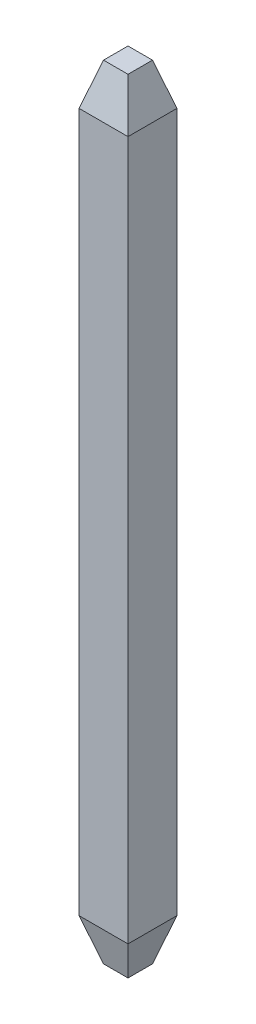
ISO-10303-21;
HEADER;
FILE_DESCRIPTION(('STEP AP214'),'2;1');
FILE_NAME('part.step','',(''),(''),'','','');
FILE_SCHEMA(('AUTOMOTIVE_DESIGN { 1 0 10303 214 1 1 1 1 }'));
ENDSEC;
DATA;
#1=APPLICATION_CONTEXT('core data for automotive mechanical design processes');
#2=APPLICATION_PROTOCOL_DEFINITION('international standard','automotive_design',2000,#1);
#3=PRODUCT_CONTEXT('',#1,'mechanical');
#4=PRODUCT('Part','Part','',(#3));
#5=PRODUCT_RELATED_PRODUCT_CATEGORY('part','',(#4));
#6=PRODUCT_DEFINITION_FORMATION('','',#4);
#7=PRODUCT_DEFINITION_CONTEXT('part definition',#1,'design');
#8=PRODUCT_DEFINITION('design','',#6,#7);
#9=PRODUCT_DEFINITION_SHAPE('','',#8);
#10=(LENGTH_UNIT() NAMED_UNIT(*) SI_UNIT(.MILLI.,.METRE.));
#11=(NAMED_UNIT(*) PLANE_ANGLE_UNIT() SI_UNIT($,.RADIAN.));
#12=(NAMED_UNIT(*) SI_UNIT($,.STERADIAN.) SOLID_ANGLE_UNIT());
#13=UNCERTAINTY_MEASURE_WITH_UNIT(LENGTH_MEASURE(1.E-05),#10,'distance_accuracy_value','');
#14=(GEOMETRIC_REPRESENTATION_CONTEXT(3) GLOBAL_UNCERTAINTY_ASSIGNED_CONTEXT((#13)) GLOBAL_UNIT_ASSIGNED_CONTEXT((#10,
#11,#12)) REPRESENTATION_CONTEXT('',''));
#15=CARTESIAN_POINT('',(0.,0.,0.));
#16=DIRECTION('',(0.,0.,1.));
#17=DIRECTION('',(1.,0.,0.));
#18=AXIS2_PLACEMENT_3D('',#15,#16,#17);
#19=CARTESIAN_POINT('',(14.4510000000129,-5.53443505344787,-19.8399999999763));
#20=DIRECTION('',(0.,0.,-1.));
#21=DIRECTION('',(0.,-1.,0.));
#22=AXIS2_PLACEMENT_3D('',#19,#20,#21);
#23=PLANE('',#22);
#24=DIRECTION('',(0.,1.,0.));
#25=VECTOR('',#24,1.);
#26=CARTESIAN_POINT('',(14.4500000000129,-10.1039999999831,-19.8399999999763));
#27=LINE('',#26,#25);
#28=CARTESIAN_POINT('',(14.4500000000129,-10.1039999999831,-19.8399999999763));
#29=VERTEX_POINT('',#28);
#30=CARTESIAN_POINT('',(14.4500000000129,-0.965870106912631,-19.8399999999763));
#31=VERTEX_POINT('',#30);
#32=EDGE_CURVE('E160',#29,#31,#27,.T.);
#33=ORIENTED_EDGE('',*,*,#32,.F.);
#34=DIRECTION('',(1.,0.,0.));
#35=VECTOR('',#34,1.);
#36=CARTESIAN_POINT('',(13.8100000000129,-10.1039999999831,-19.8399999999763));
#37=LINE('',#36,#35);
#38=CARTESIAN_POINT('',(13.8100000000129,-10.1039999999831,-19.8399999999763));
#39=VERTEX_POINT('',#38);
#40=EDGE_CURVE('E42',#39,#29,#37,.T.);
#41=ORIENTED_EDGE('',*,*,#40,.F.);
#42=DIRECTION('',(0.,1.,0.));
#43=VECTOR('',#42,1.);
#44=CARTESIAN_POINT('',(13.8100000000129,-10.1039999999831,-19.8399999999763));
#45=LINE('',#44,#43);
#46=CARTESIAN_POINT('',(13.8100000000129,-0.965870106912631,-19.8399999999763));
#47=VERTEX_POINT('',#46);
#48=EDGE_CURVE('E11',#39,#47,#45,.T.);
#49=ORIENTED_EDGE('',*,*,#48,.T.);
#50=DIRECTION('',(1.,0.,0.));
#51=VECTOR('',#50,1.);
#52=CARTESIAN_POINT('',(13.8100000000129,-0.965870106912629,-19.8399999999763));
#53=LINE('',#52,#51);
#54=EDGE_CURVE('E28',#47,#31,#53,.T.);
#55=ORIENTED_EDGE('',*,*,#54,.T.);
#56=EDGE_LOOP('',(#33,#41,#49,#55));
#57=FACE_BOUND('',#56,.T.);
#58=ADVANCED_FACE('F17',(#57),#23,.T.);
#59=CARTESIAN_POINT('',(14.4500000000129,-11.0738701069126,-19.5199999999763));
#60=DIRECTION('',(1.,0.,0.));
#61=DIRECTION('',(0.,1.,0.));
#62=AXIS2_PLACEMENT_3D('',#59,#60,#61);
#63=PLANE('',#62);
#64=DIRECTION('',(0.,1.,0.));
#65=VECTOR('',#64,1.);
#66=CARTESIAN_POINT('',(14.4500000000129,-10.1039999999831,-19.1999999999763));
#67=LINE('',#66,#65);
#68=CARTESIAN_POINT('',(14.4500000000129,-10.1039999999831,-19.1999999999763));
#69=VERTEX_POINT('',#68);
#70=CARTESIAN_POINT('',(14.4500000000129,-0.965870106912631,-19.1999999999763));
#71=VERTEX_POINT('',#70);
#72=EDGE_CURVE('E142',#69,#71,#67,.T.);
#73=ORIENTED_EDGE('',*,*,#72,.F.);
#74=DIRECTION('',(0.,0.,1.));
#75=VECTOR('',#74,1.);
#76=CARTESIAN_POINT('',(14.4500000000129,-10.1039999999831,-19.8399999999763));
#77=LINE('',#76,#75);
#78=EDGE_CURVE('E122',#29,#69,#77,.T.);
#79=ORIENTED_EDGE('',*,*,#78,.F.);
#80=ORIENTED_EDGE('',*,*,#32,.T.);
#81=DIRECTION('',(0.,0.,1.));
#82=VECTOR('',#81,1.);
#83=CARTESIAN_POINT('',(14.4500000000129,-0.965870106912629,-19.8399999999763));
#84=LINE('',#83,#82);
#85=EDGE_CURVE('E126',#31,#71,#84,.T.);
#86=ORIENTED_EDGE('',*,*,#85,.T.);
#87=EDGE_LOOP('',(#73,#79,#80,#86));
#88=FACE_BOUND('',#87,.T.);
#89=ADVANCED_FACE('F225',(#88),#63,.T.);
#90=CARTESIAN_POINT('',(13.8090000000129,-5.53543505344787,-19.1999999999763));
#91=DIRECTION('',(0.,0.,1.));
#92=DIRECTION('',(1.,0.,0.));
#93=AXIS2_PLACEMENT_3D('',#90,#91,#92);
#94=PLANE('',#93);
#95=DIRECTION('',(0.,1.,0.));
#96=VECTOR('',#95,1.);
#97=CARTESIAN_POINT('',(13.8100000000129,-10.1039999999831,-19.1999999999763));
#98=LINE('',#97,#96);
#99=CARTESIAN_POINT('',(13.8100000000129,-10.1039999999831,-19.1999999999763));
#100=VERTEX_POINT('',#99);
#101=CARTESIAN_POINT('',(13.8100000000129,-0.965870106912631,-19.1999999999763));
#102=VERTEX_POINT('',#101);
#103=EDGE_CURVE('E114',#100,#102,#98,.T.);
#104=ORIENTED_EDGE('',*,*,#103,.F.);
#105=DIRECTION('',(-1.,0.,0.));
#106=VECTOR('',#105,1.);
#107=CARTESIAN_POINT('',(14.4500000000129,-10.1039999999831,-19.1999999999763));
#108=LINE('',#107,#106);
#109=EDGE_CURVE('E176',#69,#100,#108,.T.);
#110=ORIENTED_EDGE('',*,*,#109,.F.);
#111=ORIENTED_EDGE('',*,*,#72,.T.);
#112=DIRECTION('',(-1.,0.,0.));
#113=VECTOR('',#112,1.);
#114=CARTESIAN_POINT('',(14.4500000000129,-0.965870106912629,-19.1999999999763));
#115=LINE('',#114,#113);
#116=EDGE_CURVE('E146',#71,#102,#115,.T.);
#117=ORIENTED_EDGE('',*,*,#116,.T.);
#118=EDGE_LOOP('',(#104,#110,#111,#117));
#119=FACE_BOUND('',#118,.T.);
#120=ADVANCED_FACE('F19',(#119),#94,.T.);
#121=CARTESIAN_POINT('',(14.1300000000129,-0.965870106912629,-19.1999999999763));
#122=DIRECTION('',(0.,0.281214622974643,0.959644900900968));
#123=DIRECTION('',(1.,0.,0.));
#124=AXIS2_PLACEMENT_3D('',#121,#122,#123);
#125=PLANE('',#124);
#126=DIRECTION('',(-0.270714017147724,0.923811583516618,-0.270714017147727));
#127=VECTOR('',#126,1.);
#128=CARTESIAN_POINT('',(14.4500000000129,-0.965870106912629,-19.1999999999763));
#129=LINE('',#128,#127);
#130=CARTESIAN_POINT('',(14.2900000000129,-0.419870106912631,-19.3599999999763));
#131=VERTEX_POINT('',#130);
#132=EDGE_CURVE('E21',#71,#131,#129,.T.);
#133=ORIENTED_EDGE('',*,*,#132,.T.);
#134=DIRECTION('',(-1.,0.,0.));
#135=VECTOR('',#134,1.);
#136=CARTESIAN_POINT('',(14.2900000000129,-0.419870106912629,-19.3599999999763));
#137=LINE('',#136,#135);
#138=CARTESIAN_POINT('',(13.9700000000129,-0.419870106912631,-19.3599999999763));
#139=VERTEX_POINT('',#138);
#140=EDGE_CURVE('E78',#131,#139,#137,.T.);
#141=ORIENTED_EDGE('',*,*,#140,.T.);
#142=DIRECTION('',(0.270714017147727,0.923811583516618,-0.270714017147727));
#143=VECTOR('',#142,1.);
#144=CARTESIAN_POINT('',(13.8100000000129,-0.965870106912629,-19.1999999999763));
#145=LINE('',#144,#143);
#146=EDGE_CURVE('E90',#102,#139,#145,.T.);
#147=ORIENTED_EDGE('',*,*,#146,.F.);
#148=ORIENTED_EDGE('',*,*,#116,.F.);
#149=EDGE_LOOP('',(#133,#141,#147,#148));
#150=FACE_BOUND('',#149,.T.);
#151=ADVANCED_FACE('F231',(#150),#125,.T.);
#152=CARTESIAN_POINT('',(13.8100000000129,-0.965870106912629,-19.5199999999763));
#153=DIRECTION('',(-0.959644900900968,0.281214622974643,0.));
#154=DIRECTION('',(0.,0.,1.));
#155=AXIS2_PLACEMENT_3D('',#152,#153,#154);
#156=PLANE('',#155);
#157=ORIENTED_EDGE('',*,*,#146,.T.);
#158=DIRECTION('',(0.,0.,-1.));
#159=VECTOR('',#158,1.);
#160=CARTESIAN_POINT('',(13.9700000000129,-0.419870106912629,-19.3599999999763));
#161=LINE('',#160,#159);
#162=CARTESIAN_POINT('',(13.9700000000129,-0.419870106912631,-19.6799999999763));
#163=VERTEX_POINT('',#162);
#164=EDGE_CURVE('E180',#139,#163,#161,.T.);
#165=ORIENTED_EDGE('',*,*,#164,.T.);
#166=DIRECTION('',(0.270714017147727,0.923811583516618,0.270714017147727));
#167=VECTOR('',#166,1.);
#168=CARTESIAN_POINT('',(13.8100000000129,-0.965870106912629,-19.8399999999763));
#169=LINE('',#168,#167);
#170=EDGE_CURVE('E112',#47,#163,#169,.T.);
#171=ORIENTED_EDGE('',*,*,#170,.F.);
#172=DIRECTION('',(0.,0.,-1.));
#173=VECTOR('',#172,1.);
#174=CARTESIAN_POINT('',(13.8100000000129,-0.965870106912629,-19.1999999999763));
#175=LINE('',#174,#173);
#176=EDGE_CURVE('E149',#102,#47,#175,.T.);
#177=ORIENTED_EDGE('',*,*,#176,.F.);
#178=EDGE_LOOP('',(#157,#165,#171,#177));
#179=FACE_BOUND('',#178,.T.);
#180=ADVANCED_FACE('F229',(#179),#156,.T.);
#181=CARTESIAN_POINT('',(14.1300000000129,-0.419870106912629,-19.6809999999763));
#182=DIRECTION('',(0.,1.,0.));
#183=DIRECTION('',(1.,0.,0.));
#184=AXIS2_PLACEMENT_3D('',#181,#182,#183);
#185=PLANE('',#184);
#186=DIRECTION('',(1.,0.,0.));
#187=VECTOR('',#186,1.);
#188=CARTESIAN_POINT('',(13.9700000000129,-0.419870106912629,-19.6799999999763));
#189=LINE('',#188,#187);
#190=CARTESIAN_POINT('',(14.2900000000129,-0.419870106912631,-19.6799999999763));
#191=VERTEX_POINT('',#190);
#192=EDGE_CURVE('E106',#163,#191,#189,.T.);
#193=ORIENTED_EDGE('',*,*,#192,.F.);
#194=ORIENTED_EDGE('',*,*,#164,.F.);
#195=ORIENTED_EDGE('',*,*,#140,.F.);
#196=DIRECTION('',(0.,0.,1.));
#197=VECTOR('',#196,1.);
#198=CARTESIAN_POINT('',(14.2900000000129,-0.419870106912629,-19.6799999999763));
#199=LINE('',#198,#197);
#200=EDGE_CURVE('E117',#191,#131,#199,.T.);
#201=ORIENTED_EDGE('',*,*,#200,.F.);
#202=EDGE_LOOP('',(#193,#194,#195,#201));
#203=FACE_BOUND('',#202,.T.);
#204=ADVANCED_FACE('F118',(#203),#185,.T.);
#205=CARTESIAN_POINT('',(14.1300000000129,-10.1039999999831,-19.1999999999763));
#206=DIRECTION('',(0.,-0.281214622974644,0.959644900900968));
#207=DIRECTION('',(-1.,0.,0.));
#208=AXIS2_PLACEMENT_3D('',#205,#206,#207);
#209=PLANE('',#208);
#210=ORIENTED_EDGE('',*,*,#109,.T.);
#211=DIRECTION('',(0.270714017147728,-0.923811583516617,-0.270714017147728));
#212=VECTOR('',#211,1.);
#213=CARTESIAN_POINT('',(13.8100000000129,-10.1039999999831,-19.1999999999763));
#214=LINE('',#213,#212);
#215=CARTESIAN_POINT('',(13.9700000000129,-10.6499999999831,-19.3599999999763));
#216=VERTEX_POINT('',#215);
#217=EDGE_CURVE('E181',#100,#216,#214,.T.);
#218=ORIENTED_EDGE('',*,*,#217,.T.);
#219=DIRECTION('',(-1.,0.,0.));
#220=VECTOR('',#219,1.);
#221=CARTESIAN_POINT('',(14.2900000000129,-10.6499999999831,-19.3599999999763));
#222=LINE('',#221,#220);
#223=CARTESIAN_POINT('',(14.2900000000129,-10.6499999999831,-19.3599999999763));
#224=VERTEX_POINT('',#223);
#225=EDGE_CURVE('E164',#224,#216,#222,.T.);
#226=ORIENTED_EDGE('',*,*,#225,.F.);
#227=DIRECTION('',(-0.270714017147724,-0.923811583516618,-0.270714017147728));
#228=VECTOR('',#227,1.);
#229=CARTESIAN_POINT('',(14.4500000000129,-10.1039999999831,-19.1999999999763));
#230=LINE('',#229,#228);
#231=EDGE_CURVE('E153',#69,#224,#230,.T.);
#232=ORIENTED_EDGE('',*,*,#231,.F.);
#233=EDGE_LOOP('',(#210,#218,#226,#232));
#234=FACE_BOUND('',#233,.T.);
#235=ADVANCED_FACE('F239',(#234),#209,.T.);
#236=CARTESIAN_POINT('',(13.9690000000129,-10.6499999999831,-19.5199999999763));
#237=DIRECTION('',(0.,-1.,0.));
#238=DIRECTION('',(0.,0.,-1.));
#239=AXIS2_PLACEMENT_3D('',#236,#237,#238);
#240=PLANE('',#239);
#241=DIRECTION('',(0.,0.,1.));
#242=VECTOR('',#241,1.);
#243=CARTESIAN_POINT('',(14.2900000000129,-10.6499999999831,-19.6799999999763));
#244=LINE('',#243,#242);
#245=CARTESIAN_POINT('',(14.2900000000129,-10.6499999999831,-19.6799999999763));
#246=VERTEX_POINT('',#245);
#247=EDGE_CURVE('E167',#246,#224,#244,.T.);
#248=ORIENTED_EDGE('',*,*,#247,.T.);
#249=ORIENTED_EDGE('',*,*,#225,.T.);
#250=DIRECTION('',(0.,0.,-1.));
#251=VECTOR('',#250,1.);
#252=CARTESIAN_POINT('',(13.9700000000129,-10.6499999999831,-19.3599999999763));
#253=LINE('',#252,#251);
#254=CARTESIAN_POINT('',(13.9700000000129,-10.6499999999831,-19.6799999999763));
#255=VERTEX_POINT('',#254);
#256=EDGE_CURVE('E168',#216,#255,#253,.T.);
#257=ORIENTED_EDGE('',*,*,#256,.T.);
#258=DIRECTION('',(1.,0.,0.));
#259=VECTOR('',#258,1.);
#260=CARTESIAN_POINT('',(13.9700000000129,-10.6499999999831,-19.6799999999763));
#261=LINE('',#260,#259);
#262=EDGE_CURVE('E172',#255,#246,#261,.T.);
#263=ORIENTED_EDGE('',*,*,#262,.T.);
#264=EDGE_LOOP('',(#248,#249,#257,#263));
#265=FACE_BOUND('',#264,.T.);
#266=ADVANCED_FACE('F275',(#265),#240,.T.);
#267=CARTESIAN_POINT('',(13.8100000000129,-10.1039999999831,-19.5199999999763));
#268=DIRECTION('',(-0.959644900900968,-0.281214622974644,0.));
#269=DIRECTION('',(-0.281214622974644,0.959644900900968,0.));
#270=AXIS2_PLACEMENT_3D('',#267,#268,#269);
#271=PLANE('',#270);
#272=DIRECTION('',(0.,0.,-1.));
#273=VECTOR('',#272,1.);
#274=CARTESIAN_POINT('',(13.8100000000129,-10.1039999999831,-19.1999999999763));
#275=LINE('',#274,#273);
#276=EDGE_CURVE('E136',#100,#39,#275,.T.);
#277=ORIENTED_EDGE('',*,*,#276,.T.);
#278=DIRECTION('',(0.270714017147728,-0.923811583516617,0.270714017147728));
#279=VECTOR('',#278,1.);
#280=CARTESIAN_POINT('',(13.8100000000129,-10.1039999999831,-19.8399999999763));
#281=LINE('',#280,#279);
#282=EDGE_CURVE('E129',#39,#255,#281,.T.);
#283=ORIENTED_EDGE('',*,*,#282,.T.);
#284=ORIENTED_EDGE('',*,*,#256,.F.);
#285=ORIENTED_EDGE('',*,*,#217,.F.);
#286=EDGE_LOOP('',(#277,#283,#284,#285));
#287=FACE_BOUND('',#286,.T.);
#288=ADVANCED_FACE('F268',(#287),#271,.T.);
#289=CARTESIAN_POINT('',(14.4500000000129,-0.965870106912629,-19.5199999999763));
#290=DIRECTION('',(0.95964490090097,0.281214622974639,0.));
#291=DIRECTION('',(0.,0.,-1.));
#292=AXIS2_PLACEMENT_3D('',#289,#290,#291);
#293=PLANE('',#292);
#294=DIRECTION('',(-0.270714017147724,0.923811583516618,0.270714017147727));
#295=VECTOR('',#294,1.);
#296=CARTESIAN_POINT('',(14.4500000000129,-0.965870106912629,-19.8399999999763));
#297=LINE('',#296,#295);
#298=EDGE_CURVE('E110',#31,#191,#297,.T.);
#299=ORIENTED_EDGE('',*,*,#298,.T.);
#300=ORIENTED_EDGE('',*,*,#200,.T.);
#301=ORIENTED_EDGE('',*,*,#132,.F.);
#302=ORIENTED_EDGE('',*,*,#85,.F.);
#303=EDGE_LOOP('',(#299,#300,#301,#302));
#304=FACE_BOUND('',#303,.T.);
#305=ADVANCED_FACE('F124',(#304),#293,.T.);
#306=CARTESIAN_POINT('',(14.4500000000129,-10.1039999999831,-19.5199999999763));
#307=DIRECTION('',(0.959644900900969,-0.281214622974641,0.));
#308=DIRECTION('',(0.,0.,-1.));
#309=AXIS2_PLACEMENT_3D('',#306,#307,#308);
#310=PLANE('',#309);
#311=ORIENTED_EDGE('',*,*,#78,.T.);
#312=ORIENTED_EDGE('',*,*,#231,.T.);
#313=ORIENTED_EDGE('',*,*,#247,.F.);
#314=DIRECTION('',(-0.270714017147724,-0.923811583516618,0.270714017147728));
#315=VECTOR('',#314,1.);
#316=CARTESIAN_POINT('',(14.4500000000129,-10.1039999999831,-19.8399999999763));
#317=LINE('',#316,#315);
#318=EDGE_CURVE('E139',#29,#246,#317,.T.);
#319=ORIENTED_EDGE('',*,*,#318,.F.);
#320=EDGE_LOOP('',(#311,#312,#313,#319));
#321=FACE_BOUND('',#320,.T.);
#322=ADVANCED_FACE('F252',(#321),#310,.T.);
#323=CARTESIAN_POINT('',(14.1300000000129,-0.965870106912629,-19.8399999999763));
#324=DIRECTION('',(0.,0.281214622974643,-0.959644900900968));
#325=DIRECTION('',(-1.,0.,0.));
#326=AXIS2_PLACEMENT_3D('',#323,#324,#325);
#327=PLANE('',#326);
#328=ORIENTED_EDGE('',*,*,#170,.T.);
#329=ORIENTED_EDGE('',*,*,#192,.T.);
#330=ORIENTED_EDGE('',*,*,#298,.F.);
#331=ORIENTED_EDGE('',*,*,#54,.F.);
#332=EDGE_LOOP('',(#328,#329,#330,#331));
#333=FACE_BOUND('',#332,.T.);
#334=ADVANCED_FACE('F107',(#333),#327,.T.);
#335=CARTESIAN_POINT('',(13.8100000000129,-5.53543505344786,-19.1989999999763));
#336=DIRECTION('',(-1.,0.,0.));
#337=DIRECTION('',(0.,0.,1.));
#338=AXIS2_PLACEMENT_3D('',#335,#336,#337);
#339=PLANE('',#338);
#340=ORIENTED_EDGE('',*,*,#48,.F.);
#341=ORIENTED_EDGE('',*,*,#276,.F.);
#342=ORIENTED_EDGE('',*,*,#103,.T.);
#343=ORIENTED_EDGE('',*,*,#176,.T.);
#344=EDGE_LOOP('',(#340,#341,#342,#343));
#345=FACE_BOUND('',#344,.T.);
#346=ADVANCED_FACE('F256',(#345),#339,.T.);
#347=CARTESIAN_POINT('',(14.1300000000129,-10.1039999999831,-19.8399999999763));
#348=DIRECTION('',(0.,-0.281214622974644,-0.959644900900968));
#349=DIRECTION('',(0.,-0.959644900900968,0.281214622974644));
#350=AXIS2_PLACEMENT_3D('',#347,#348,#349);
#351=PLANE('',#350);
#352=ORIENTED_EDGE('',*,*,#40,.T.);
#353=ORIENTED_EDGE('',*,*,#318,.T.);
#354=ORIENTED_EDGE('',*,*,#262,.F.);
#355=ORIENTED_EDGE('',*,*,#282,.F.);
#356=EDGE_LOOP('',(#352,#353,#354,#355));
#357=FACE_BOUND('',#356,.T.);
#358=ADVANCED_FACE('F262',(#357),#351,.T.);
#359=CLOSED_SHELL('',(#58,#89,#120,#151,#180,#204,#235,#266,#288,#305,#322,#334,#346,#358));
#360=MANIFOLD_SOLID_BREP('B1',#359);
#361=ADVANCED_BREP_SHAPE_REPRESENTATION('',(#18,#360),#14);
#362=SHAPE_DEFINITION_REPRESENTATION(#9,#361);
ENDSEC;
END-ISO-10303-21;
